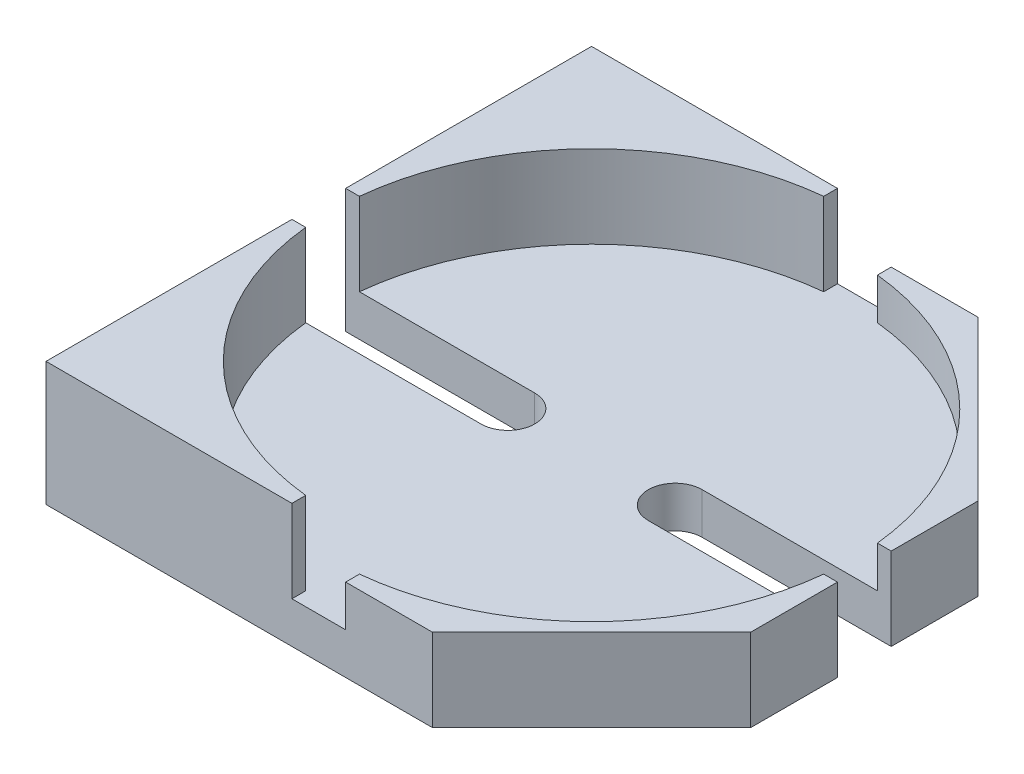
ISO-10303-21;
HEADER;
FILE_DESCRIPTION(('STEP AP214'),'2;1');
FILE_NAME('part.step','',(''),(''),'','','');
FILE_SCHEMA(('AUTOMOTIVE_DESIGN { 1 0 10303 214 1 1 1 1 }'));
ENDSEC;
DATA;
#1=APPLICATION_CONTEXT('core data for automotive mechanical design processes');
#2=APPLICATION_PROTOCOL_DEFINITION('international standard','automotive_design',2000,#1);
#3=PRODUCT_CONTEXT('',#1,'mechanical');
#4=PRODUCT('Part','Part','',(#3));
#5=PRODUCT_RELATED_PRODUCT_CATEGORY('part','',(#4));
#6=PRODUCT_DEFINITION_FORMATION('','',#4);
#7=PRODUCT_DEFINITION_CONTEXT('part definition',#1,'design');
#8=PRODUCT_DEFINITION('design','',#6,#7);
#9=PRODUCT_DEFINITION_SHAPE('','',#8);
#10=(LENGTH_UNIT() NAMED_UNIT(*) SI_UNIT(.MILLI.,.METRE.));
#11=(NAMED_UNIT(*) PLANE_ANGLE_UNIT() SI_UNIT($,.RADIAN.));
#12=(NAMED_UNIT(*) SI_UNIT($,.STERADIAN.) SOLID_ANGLE_UNIT());
#13=UNCERTAINTY_MEASURE_WITH_UNIT(LENGTH_MEASURE(1.E-05),#10,'distance_accuracy_value','');
#14=(GEOMETRIC_REPRESENTATION_CONTEXT(3) GLOBAL_UNCERTAINTY_ASSIGNED_CONTEXT((#13)) GLOBAL_UNIT_ASSIGNED_CONTEXT((#10,
#11,#12)) REPRESENTATION_CONTEXT('',''));
#15=CARTESIAN_POINT('',(0.,0.,0.));
#16=DIRECTION('',(0.,0.,1.));
#17=DIRECTION('',(1.,0.,0.));
#18=AXIS2_PLACEMENT_3D('',#15,#16,#17);
#19=CARTESIAN_POINT('',(0.,1.,0.));
#20=DIRECTION('',(0.,1.,0.));
#21=DIRECTION('',(1.,0.,0.));
#22=AXIS2_PLACEMENT_3D('',#19,#20,#21);
#23=PLANE('',#22);
#24=CARTESIAN_POINT('',(0.,1.,0.));
#25=DIRECTION('',(0.,1.,0.));
#26=DIRECTION('',(0.,0.,1.));
#27=AXIS2_PLACEMENT_3D('',#24,#25,#26);
#28=CIRCLE('',#27,3.15);
#29=CARTESIAN_POINT('',(0.325000000000011,1.,3.13318926973778));
#30=VERTEX_POINT('',#29);
#31=CARTESIAN_POINT('',(3.13318926973778,1.,0.325));
#32=VERTEX_POINT('',#31);
#33=EDGE_CURVE('E21',#30,#32,#28,.T.);
#34=ORIENTED_EDGE('',*,*,#33,.F.);
#35=DIRECTION('',(0.,0.,-1.));
#36=VECTOR('',#35,1.);
#37=CARTESIAN_POINT('',(0.325000000000011,1.,0.));
#38=LINE('',#37,#36);
#39=CARTESIAN_POINT('',(0.325000000000011,1.,3.3));
#40=VERTEX_POINT('',#39);
#41=EDGE_CURVE('E11',#40,#30,#38,.T.);
#42=ORIENTED_EDGE('',*,*,#41,.F.);
#43=DIRECTION('',(1.,0.,0.));
#44=VECTOR('',#43,1.);
#45=CARTESIAN_POINT('',(0.,1.,3.3));
#46=LINE('',#45,#44);
#47=CARTESIAN_POINT('',(1.37500000000002,1.,3.3));
#48=VERTEX_POINT('',#47);
#49=EDGE_CURVE('E261',#40,#48,#46,.T.);
#50=ORIENTED_EDGE('',*,*,#49,.T.);
#51=DIRECTION('',(0.707106781186544,0.,-0.707106781186552));
#52=VECTOR('',#51,1.);
#53=CARTESIAN_POINT('',(2.3375,1.,2.3375));
#54=LINE('',#53,#52);
#55=CARTESIAN_POINT('',(3.3,1.,1.375));
#56=VERTEX_POINT('',#55);
#57=EDGE_CURVE('E345',#48,#56,#54,.T.);
#58=ORIENTED_EDGE('',*,*,#57,.T.);
#59=DIRECTION('',(0.,0.,-1.));
#60=VECTOR('',#59,1.);
#61=CARTESIAN_POINT('',(3.3,1.,0.));
#62=LINE('',#61,#60);
#63=CARTESIAN_POINT('',(3.3,1.,0.325));
#64=VERTEX_POINT('',#63);
#65=EDGE_CURVE('E363',#56,#64,#62,.T.);
#66=ORIENTED_EDGE('',*,*,#65,.T.);
#67=DIRECTION('',(-1.,0.,0.));
#68=VECTOR('',#67,1.);
#69=CARTESIAN_POINT('',(0.,1.,0.325));
#70=LINE('',#69,#68);
#71=EDGE_CURVE('E317',#64,#32,#70,.T.);
#72=ORIENTED_EDGE('',*,*,#71,.T.);
#73=EDGE_LOOP('',(#34,#42,#50,#58,#66,#72));
#74=FACE_BOUND('',#73,.T.);
#75=ADVANCED_FACE('F17',(#74),#23,.T.);
#76=CARTESIAN_POINT('',(0.325000000000011,1.,0.));
#77=DIRECTION('',(-1.,0.,0.));
#78=DIRECTION('',(0.,0.,1.));
#79=AXIS2_PLACEMENT_3D('',#76,#77,#78);
#80=PLANE('',#79);
#81=DIRECTION('',(0.,0.,-1.));
#82=VECTOR('',#81,1.);
#83=CARTESIAN_POINT('',(0.325000000000011,0.5,0.));
#84=LINE('',#83,#82);
#85=CARTESIAN_POINT('',(0.325000000000011,0.5,3.3));
#86=VERTEX_POINT('',#85);
#87=CARTESIAN_POINT('',(0.325000000000011,0.5,3.13318926973778));
#88=VERTEX_POINT('',#87);
#89=EDGE_CURVE('E266',#86,#88,#84,.T.);
#90=ORIENTED_EDGE('',*,*,#89,.F.);
#91=DIRECTION('',(0.,-1.,0.));
#92=VECTOR('',#91,1.);
#93=CARTESIAN_POINT('',(0.325000000000011,1.,3.3));
#94=LINE('',#93,#92);
#95=EDGE_CURVE('E251',#40,#86,#94,.T.);
#96=ORIENTED_EDGE('',*,*,#95,.F.);
#97=ORIENTED_EDGE('',*,*,#41,.T.);
#98=DIRECTION('',(0.,-1.,0.));
#99=VECTOR('',#98,1.);
#100=CARTESIAN_POINT('',(0.325000000000011,1.,3.13318926973778));
#101=LINE('',#100,#99);
#102=EDGE_CURVE('E268',#30,#88,#101,.T.);
#103=ORIENTED_EDGE('',*,*,#102,.T.);
#104=EDGE_LOOP('',(#90,#96,#97,#103));
#105=FACE_BOUND('',#104,.T.);
#106=ADVANCED_FACE('F19',(#105),#80,.T.);
#107=CARTESIAN_POINT('',(0.,1.,0.));
#108=DIRECTION('',(0.,-1.,0.));
#109=DIRECTION('',(0.,0.,-1.));
#110=AXIS2_PLACEMENT_3D('',#107,#108,#109);
#111=CYLINDRICAL_SURFACE('',#110,3.15);
#112=CARTESIAN_POINT('',(0.,0.5,0.));
#113=DIRECTION('',(0.,1.,0.));
#114=DIRECTION('',(0.,0.,1.));
#115=AXIS2_PLACEMENT_3D('',#112,#113,#114);
#116=CIRCLE('',#115,3.15);
#117=CARTESIAN_POINT('',(3.13318926973778,0.5,0.325));
#118=VERTEX_POINT('',#117);
#119=EDGE_CURVE('E1458',#88,#118,#116,.T.);
#120=ORIENTED_EDGE('',*,*,#119,.F.);
#121=ORIENTED_EDGE('',*,*,#102,.F.);
#122=ORIENTED_EDGE('',*,*,#33,.T.);
#123=DIRECTION('',(0.,-1.,0.));
#124=VECTOR('',#123,1.);
#125=CARTESIAN_POINT('',(3.13318926973778,1.,0.325));
#126=LINE('',#125,#124);
#127=EDGE_CURVE('E289',#32,#118,#126,.T.);
#128=ORIENTED_EDGE('',*,*,#127,.T.);
#129=EDGE_LOOP('',(#120,#121,#122,#128));
#130=FACE_BOUND('',#129,.T.);
#131=ADVANCED_FACE('F494',(#130),#111,.F.);
#132=CARTESIAN_POINT('',(0.,1.,0.));
#133=DIRECTION('',(0.,1.,0.));
#134=DIRECTION('',(1.,0.,0.));
#135=AXIS2_PLACEMENT_3D('',#132,#133,#134);
#136=PLANE('',#135);
#137=CARTESIAN_POINT('',(0.,1.,0.));
#138=DIRECTION('',(0.,1.,0.));
#139=DIRECTION('',(0.,0.,1.));
#140=AXIS2_PLACEMENT_3D('',#137,#138,#139);
#141=CIRCLE('',#140,3.15);
#142=CARTESIAN_POINT('',(3.13318926973778,1.,-0.325));
#143=VERTEX_POINT('',#142);
#144=CARTESIAN_POINT('',(0.325000000000005,1.,-3.13318926973778));
#145=VERTEX_POINT('',#144);
#146=EDGE_CURVE('E371',#143,#145,#141,.T.);
#147=ORIENTED_EDGE('',*,*,#146,.F.);
#148=DIRECTION('',(1.,0.,0.));
#149=VECTOR('',#148,1.);
#150=CARTESIAN_POINT('',(0.,1.,-0.325));
#151=LINE('',#150,#149);
#152=CARTESIAN_POINT('',(3.3,1.,-0.325));
#153=VERTEX_POINT('',#152);
#154=EDGE_CURVE('E400',#143,#153,#151,.T.);
#155=ORIENTED_EDGE('',*,*,#154,.T.);
#156=DIRECTION('',(0.,0.,-1.));
#157=VECTOR('',#156,1.);
#158=CARTESIAN_POINT('',(3.3,1.,0.));
#159=LINE('',#158,#157);
#160=CARTESIAN_POINT('',(3.3,1.,-1.375));
#161=VERTEX_POINT('',#160);
#162=EDGE_CURVE('E296',#153,#161,#159,.T.);
#163=ORIENTED_EDGE('',*,*,#162,.T.);
#164=DIRECTION('',(-0.707106781186549,0.,-0.707106781186546));
#165=VECTOR('',#164,1.);
#166=CARTESIAN_POINT('',(2.3375,1.,-2.3375));
#167=LINE('',#166,#165);
#168=CARTESIAN_POINT('',(1.375,1.,-3.3));
#169=VERTEX_POINT('',#168);
#170=EDGE_CURVE('E436',#161,#169,#167,.T.);
#171=ORIENTED_EDGE('',*,*,#170,.T.);
#172=DIRECTION('',(-1.,0.,0.));
#173=VECTOR('',#172,1.);
#174=CARTESIAN_POINT('',(0.,1.,-3.3));
#175=LINE('',#174,#173);
#176=CARTESIAN_POINT('',(0.325000000000005,1.,-3.3));
#177=VERTEX_POINT('',#176);
#178=EDGE_CURVE('E456',#169,#177,#175,.T.);
#179=ORIENTED_EDGE('',*,*,#178,.T.);
#180=DIRECTION('',(0.,0.,1.));
#181=VECTOR('',#180,1.);
#182=CARTESIAN_POINT('',(0.325000000000005,1.,0.));
#183=LINE('',#182,#181);
#184=EDGE_CURVE('E49',#177,#145,#183,.T.);
#185=ORIENTED_EDGE('',*,*,#184,.T.);
#186=EDGE_LOOP('',(#147,#155,#163,#171,#179,#185));
#187=FACE_BOUND('',#186,.T.);
#188=ADVANCED_FACE('F1038',(#187),#136,.T.);
#189=CARTESIAN_POINT('',(0.325000000000005,1.,0.));
#190=DIRECTION('',(1.,0.,0.));
#191=DIRECTION('',(0.,1.,0.));
#192=AXIS2_PLACEMENT_3D('',#189,#190,#191);
#193=PLANE('',#192);
#194=DIRECTION('',(0.,0.,1.));
#195=VECTOR('',#194,1.);
#196=CARTESIAN_POINT('',(0.325000000000005,0.5,0.));
#197=LINE('',#196,#195);
#198=CARTESIAN_POINT('',(0.325000000000005,0.5,-3.3));
#199=VERTEX_POINT('',#198);
#200=CARTESIAN_POINT('',(0.325000000000005,0.5,-3.13318926973778));
#201=VERTEX_POINT('',#200);
#202=EDGE_CURVE('E650',#199,#201,#197,.T.);
#203=ORIENTED_EDGE('',*,*,#202,.T.);
#204=DIRECTION('',(0.,-1.,0.));
#205=VECTOR('',#204,1.);
#206=CARTESIAN_POINT('',(0.325000000000005,1.,-3.13318926973778));
#207=LINE('',#206,#205);
#208=EDGE_CURVE('E368',#145,#201,#207,.T.);
#209=ORIENTED_EDGE('',*,*,#208,.F.);
#210=ORIENTED_EDGE('',*,*,#184,.F.);
#211=DIRECTION('',(0.,-1.,0.));
#212=VECTOR('',#211,1.);
#213=CARTESIAN_POINT('',(0.325000000000005,1.,-3.3));
#214=LINE('',#213,#212);
#215=EDGE_CURVE('E455',#177,#199,#214,.T.);
#216=ORIENTED_EDGE('',*,*,#215,.T.);
#217=EDGE_LOOP('',(#203,#209,#210,#216));
#218=FACE_BOUND('',#217,.T.);
#219=ADVANCED_FACE('F1029',(#218),#193,.F.);
#220=CARTESIAN_POINT('',(0.,1.,0.));
#221=DIRECTION('',(0.,-1.,0.));
#222=DIRECTION('',(0.,0.,-1.));
#223=AXIS2_PLACEMENT_3D('',#220,#221,#222);
#224=CYLINDRICAL_SURFACE('',#223,3.15);
#225=CARTESIAN_POINT('',(0.,0.5,0.));
#226=DIRECTION('',(0.,1.,0.));
#227=DIRECTION('',(0.,0.,1.));
#228=AXIS2_PLACEMENT_3D('',#225,#226,#227);
#229=CIRCLE('',#228,3.15);
#230=CARTESIAN_POINT('',(3.13318926973778,0.5,-0.325));
#231=VERTEX_POINT('',#230);
#232=EDGE_CURVE('E655',#231,#201,#229,.T.);
#233=ORIENTED_EDGE('',*,*,#232,.F.);
#234=DIRECTION('',(0.,-1.,0.));
#235=VECTOR('',#234,1.);
#236=CARTESIAN_POINT('',(3.13318926973778,1.,-0.325));
#237=LINE('',#236,#235);
#238=EDGE_CURVE('E404',#143,#231,#237,.T.);
#239=ORIENTED_EDGE('',*,*,#238,.F.);
#240=ORIENTED_EDGE('',*,*,#146,.T.);
#241=ORIENTED_EDGE('',*,*,#208,.T.);
#242=EDGE_LOOP('',(#233,#239,#240,#241));
#243=FACE_BOUND('',#242,.T.);
#244=ADVANCED_FACE('F1020',(#243),#224,.F.);
#245=CARTESIAN_POINT('',(0.,1.5,0.));
#246=DIRECTION('',(0.,1.,0.));
#247=DIRECTION('',(1.,0.,0.));
#248=AXIS2_PLACEMENT_3D('',#245,#246,#247);
#249=PLANE('',#248);
#250=CARTESIAN_POINT('',(0.,1.5,0.));
#251=DIRECTION('',(0.,1.,0.));
#252=DIRECTION('',(0.,0.,1.));
#253=AXIS2_PLACEMENT_3D('',#250,#251,#252);
#254=CIRCLE('',#253,3.15);
#255=CARTESIAN_POINT('',(-3.13318926973778,1.5,0.325));
#256=VERTEX_POINT('',#255);
#257=CARTESIAN_POINT('',(-0.325,1.5,3.13318926973778));
#258=VERTEX_POINT('',#257);
#259=EDGE_CURVE('E411',#256,#258,#254,.T.);
#260=ORIENTED_EDGE('',*,*,#259,.F.);
#261=DIRECTION('',(-1.,0.,0.));
#262=VECTOR('',#261,1.);
#263=CARTESIAN_POINT('',(0.,1.5,0.325));
#264=LINE('',#263,#262);
#265=CARTESIAN_POINT('',(-3.3,1.5,0.325));
#266=VERTEX_POINT('',#265);
#267=EDGE_CURVE('E470',#256,#266,#264,.T.);
#268=ORIENTED_EDGE('',*,*,#267,.T.);
#269=DIRECTION('',(0.,0.,1.));
#270=VECTOR('',#269,1.);
#271=CARTESIAN_POINT('',(-3.3,1.5,0.));
#272=LINE('',#271,#270);
#273=CARTESIAN_POINT('',(-3.3,1.5,3.3));
#274=VERTEX_POINT('',#273);
#275=EDGE_CURVE('E312',#266,#274,#272,.T.);
#276=ORIENTED_EDGE('',*,*,#275,.T.);
#277=DIRECTION('',(1.,0.,0.));
#278=VECTOR('',#277,1.);
#279=CARTESIAN_POINT('',(0.,1.5,3.3));
#280=LINE('',#279,#278);
#281=CARTESIAN_POINT('',(-0.325,1.5,3.3));
#282=VERTEX_POINT('',#281);
#283=EDGE_CURVE('E333',#274,#282,#280,.T.);
#284=ORIENTED_EDGE('',*,*,#283,.T.);
#285=DIRECTION('',(0.,0.,-1.));
#286=VECTOR('',#285,1.);
#287=CARTESIAN_POINT('',(-0.325,1.5,0.));
#288=LINE('',#287,#286);
#289=EDGE_CURVE('E482',#282,#258,#288,.T.);
#290=ORIENTED_EDGE('',*,*,#289,.T.);
#291=EDGE_LOOP('',(#260,#268,#276,#284,#290));
#292=FACE_BOUND('',#291,.T.);
#293=ADVANCED_FACE('F1011',(#292),#249,.T.);
#294=CARTESIAN_POINT('',(-0.325,1.5,0.));
#295=DIRECTION('',(-1.,0.,0.));
#296=DIRECTION('',(0.,0.,1.));
#297=AXIS2_PLACEMENT_3D('',#294,#295,#296);
#298=PLANE('',#297);
#299=DIRECTION('',(0.,0.,-1.));
#300=VECTOR('',#299,1.);
#301=CARTESIAN_POINT('',(-0.325,0.5,0.));
#302=LINE('',#301,#300);
#303=CARTESIAN_POINT('',(-0.325,0.5,3.3));
#304=VERTEX_POINT('',#303);
#305=CARTESIAN_POINT('',(-0.325,0.5,3.13318926973778));
#306=VERTEX_POINT('',#305);
#307=EDGE_CURVE('E278',#304,#306,#302,.T.);
#308=ORIENTED_EDGE('',*,*,#307,.T.);
#309=DIRECTION('',(0.,-1.,0.));
#310=VECTOR('',#309,1.);
#311=CARTESIAN_POINT('',(-0.325,1.5,3.13318926973778));
#312=LINE('',#311,#310);
#313=EDGE_CURVE('E479',#258,#306,#312,.T.);
#314=ORIENTED_EDGE('',*,*,#313,.F.);
#315=ORIENTED_EDGE('',*,*,#289,.F.);
#316=DIRECTION('',(0.,-1.,0.));
#317=VECTOR('',#316,1.);
#318=CARTESIAN_POINT('',(-0.325,1.5,3.3));
#319=LINE('',#318,#317);
#320=EDGE_CURVE('E263',#282,#304,#319,.T.);
#321=ORIENTED_EDGE('',*,*,#320,.T.);
#322=EDGE_LOOP('',(#308,#314,#315,#321));
#323=FACE_BOUND('',#322,.T.);
#324=ADVANCED_FACE('F1002',(#323),#298,.F.);
#325=CARTESIAN_POINT('',(0.,1.5,0.));
#326=DIRECTION('',(0.,-1.,0.));
#327=DIRECTION('',(0.,0.,-1.));
#328=AXIS2_PLACEMENT_3D('',#325,#326,#327);
#329=CYLINDRICAL_SURFACE('',#328,3.15);
#330=CARTESIAN_POINT('',(0.,0.5,0.));
#331=DIRECTION('',(0.,1.,0.));
#332=DIRECTION('',(0.,0.,1.));
#333=AXIS2_PLACEMENT_3D('',#330,#331,#332);
#334=CIRCLE('',#333,3.15);
#335=CARTESIAN_POINT('',(-3.13318926973778,0.5,0.325));
#336=VERTEX_POINT('',#335);
#337=EDGE_CURVE('E285',#336,#306,#334,.T.);
#338=ORIENTED_EDGE('',*,*,#337,.F.);
#339=DIRECTION('',(0.,-1.,0.));
#340=VECTOR('',#339,1.);
#341=CARTESIAN_POINT('',(-3.13318926973778,1.5,0.325));
#342=LINE('',#341,#340);
#343=EDGE_CURVE('E473',#256,#336,#342,.T.);
#344=ORIENTED_EDGE('',*,*,#343,.F.);
#345=ORIENTED_EDGE('',*,*,#259,.T.);
#346=ORIENTED_EDGE('',*,*,#313,.T.);
#347=EDGE_LOOP('',(#338,#344,#345,#346));
#348=FACE_BOUND('',#347,.T.);
#349=ADVANCED_FACE('F993',(#348),#329,.F.);
#350=CARTESIAN_POINT('',(0.,1.5,0.));
#351=DIRECTION('',(0.,1.,0.));
#352=DIRECTION('',(1.,0.,0.));
#353=AXIS2_PLACEMENT_3D('',#350,#351,#352);
#354=PLANE('',#353);
#355=CARTESIAN_POINT('',(0.,1.5,0.));
#356=DIRECTION('',(0.,1.,0.));
#357=DIRECTION('',(0.,0.,1.));
#358=AXIS2_PLACEMENT_3D('',#355,#356,#357);
#359=CIRCLE('',#358,3.15);
#360=CARTESIAN_POINT('',(-0.325000000000007,1.5,-3.13318926973778));
#361=VERTEX_POINT('',#360);
#362=CARTESIAN_POINT('',(-3.13318926973778,1.5,-0.325));
#363=VERTEX_POINT('',#362);
#364=EDGE_CURVE('E412',#361,#363,#359,.T.);
#365=ORIENTED_EDGE('',*,*,#364,.F.);
#366=DIRECTION('',(0.,0.,1.));
#367=VECTOR('',#366,1.);
#368=CARTESIAN_POINT('',(-0.325000000000009,1.5,0.));
#369=LINE('',#368,#367);
#370=CARTESIAN_POINT('',(-0.325000000000007,1.5,-3.3));
#371=VERTEX_POINT('',#370);
#372=EDGE_CURVE('E408',#371,#361,#369,.T.);
#373=ORIENTED_EDGE('',*,*,#372,.F.);
#374=DIRECTION('',(-1.,0.,0.));
#375=VECTOR('',#374,1.);
#376=CARTESIAN_POINT('',(0.,1.5,-3.3));
#377=LINE('',#376,#375);
#378=CARTESIAN_POINT('',(-3.3,1.5,-3.3));
#379=VERTEX_POINT('',#378);
#380=EDGE_CURVE('E448',#371,#379,#377,.T.);
#381=ORIENTED_EDGE('',*,*,#380,.T.);
#382=DIRECTION('',(0.,0.,1.));
#383=VECTOR('',#382,1.);
#384=CARTESIAN_POINT('',(-3.3,1.5,0.));
#385=LINE('',#384,#383);
#386=CARTESIAN_POINT('',(-3.3,1.5,-0.325));
#387=VERTEX_POINT('',#386);
#388=EDGE_CURVE('E294',#379,#387,#385,.T.);
#389=ORIENTED_EDGE('',*,*,#388,.T.);
#390=DIRECTION('',(1.,0.,0.));
#391=VECTOR('',#390,1.);
#392=CARTESIAN_POINT('',(0.,1.5,-0.325));
#393=LINE('',#392,#391);
#394=EDGE_CURVE('E419',#387,#363,#393,.T.);
#395=ORIENTED_EDGE('',*,*,#394,.T.);
#396=EDGE_LOOP('',(#365,#373,#381,#389,#395));
#397=FACE_BOUND('',#396,.T.);
#398=ADVANCED_FACE('F896',(#397),#354,.T.);
#399=CARTESIAN_POINT('',(-0.325000000000009,1.5,0.));
#400=DIRECTION('',(1.,0.,0.));
#401=DIRECTION('',(0.,0.,1.));
#402=AXIS2_PLACEMENT_3D('',#399,#400,#401);
#403=PLANE('',#402);
#404=DIRECTION('',(0.,0.,1.));
#405=VECTOR('',#404,1.);
#406=CARTESIAN_POINT('',(-0.325000000000009,0.5,0.));
#407=LINE('',#406,#405);
#408=CARTESIAN_POINT('',(-0.325000000000007,0.5,-3.3));
#409=VERTEX_POINT('',#408);
#410=CARTESIAN_POINT('',(-0.325000000000007,0.5,-3.13318926973778));
#411=VERTEX_POINT('',#410);
#412=EDGE_CURVE('E1472',#409,#411,#407,.T.);
#413=ORIENTED_EDGE('',*,*,#412,.F.);
#414=DIRECTION('',(0.,-1.,0.));
#415=VECTOR('',#414,1.);
#416=CARTESIAN_POINT('',(-0.325000000000007,1.5,-3.3));
#417=LINE('',#416,#415);
#418=EDGE_CURVE('E452',#371,#409,#417,.T.);
#419=ORIENTED_EDGE('',*,*,#418,.F.);
#420=ORIENTED_EDGE('',*,*,#372,.T.);
#421=DIRECTION('',(0.,-1.,0.));
#422=VECTOR('',#421,1.);
#423=CARTESIAN_POINT('',(-0.325000000000007,1.5,-3.13318926973778));
#424=LINE('',#423,#422);
#425=EDGE_CURVE('E415',#361,#411,#424,.T.);
#426=ORIENTED_EDGE('',*,*,#425,.T.);
#427=EDGE_LOOP('',(#413,#419,#420,#426));
#428=FACE_BOUND('',#427,.T.);
#429=ADVANCED_FACE('F891',(#428),#403,.T.);
#430=CARTESIAN_POINT('',(0.,1.5,0.));
#431=DIRECTION('',(0.,-1.,0.));
#432=DIRECTION('',(0.,0.,-1.));
#433=AXIS2_PLACEMENT_3D('',#430,#431,#432);
#434=CYLINDRICAL_SURFACE('',#433,3.15);
#435=CARTESIAN_POINT('',(0.,0.5,0.));
#436=DIRECTION('',(0.,1.,0.));
#437=DIRECTION('',(0.,0.,1.));
#438=AXIS2_PLACEMENT_3D('',#435,#436,#437);
#439=CIRCLE('',#438,3.15);
#440=CARTESIAN_POINT('',(-3.13318926973778,0.5,-0.325));
#441=VERTEX_POINT('',#440);
#442=EDGE_CURVE('E601',#411,#441,#439,.T.);
#443=ORIENTED_EDGE('',*,*,#442,.F.);
#444=ORIENTED_EDGE('',*,*,#425,.F.);
#445=ORIENTED_EDGE('',*,*,#364,.T.);
#446=DIRECTION('',(0.,-1.,0.));
#447=VECTOR('',#446,1.);
#448=CARTESIAN_POINT('',(-3.13318926973778,1.5,-0.325));
#449=LINE('',#448,#447);
#450=EDGE_CURVE('E354',#363,#441,#449,.T.);
#451=ORIENTED_EDGE('',*,*,#450,.T.);
#452=EDGE_LOOP('',(#443,#444,#445,#451));
#453=FACE_BOUND('',#452,.T.);
#454=ADVANCED_FACE('F895',(#453),#434,.F.);
#455=CARTESIAN_POINT('',(1.0125,0.,0.));
#456=DIRECTION('',(0.,1.,0.));
#457=DIRECTION('',(1.,0.,0.));
#458=AXIS2_PLACEMENT_3D('',#455,#456,#457);
#459=PLANE('',#458);
#460=DIRECTION('',(0.,0.,1.));
#461=VECTOR('',#460,1.);
#462=CARTESIAN_POINT('',(-3.3,0.,0.325));
#463=LINE('',#462,#461);
#464=CARTESIAN_POINT('',(-3.3,0.,0.325));
#465=VERTEX_POINT('',#464);
#466=CARTESIAN_POINT('',(-3.3,0.,3.3));
#467=VERTEX_POINT('',#466);
#468=EDGE_CURVE('E273',#465,#467,#463,.T.);
#469=ORIENTED_EDGE('',*,*,#468,.F.);
#470=DIRECTION('',(-1.,0.,0.));
#471=VECTOR('',#470,1.);
#472=CARTESIAN_POINT('',(-1.0125,0.,0.325));
#473=LINE('',#472,#471);
#474=CARTESIAN_POINT('',(-1.0125,0.,0.325));
#475=VERTEX_POINT('',#474);
#476=EDGE_CURVE('E395',#475,#465,#473,.T.);
#477=ORIENTED_EDGE('',*,*,#476,.F.);
#478=CARTESIAN_POINT('',(-1.0125,0.,0.));
#479=DIRECTION('',(0.,-1.,0.));
#480=DIRECTION('',(0.,0.,1.));
#481=AXIS2_PLACEMENT_3D('',#478,#479,#480);
#482=CIRCLE('',#481,0.325);
#483=CARTESIAN_POINT('',(-1.0125,0.,-0.325));
#484=VERTEX_POINT('',#483);
#485=EDGE_CURVE('E396',#484,#475,#482,.T.);
#486=ORIENTED_EDGE('',*,*,#485,.F.);
#487=DIRECTION('',(1.,0.,0.));
#488=VECTOR('',#487,1.);
#489=CARTESIAN_POINT('',(-1.0125,0.,-0.325));
#490=LINE('',#489,#488);
#491=CARTESIAN_POINT('',(-3.3,0.,-0.325));
#492=VERTEX_POINT('',#491);
#493=EDGE_CURVE('E355',#492,#484,#490,.T.);
#494=ORIENTED_EDGE('',*,*,#493,.F.);
#495=DIRECTION('',(0.,0.,1.));
#496=VECTOR('',#495,1.);
#497=CARTESIAN_POINT('',(-3.3,0.,-3.3));
#498=LINE('',#497,#496);
#499=CARTESIAN_POINT('',(-3.3,0.,-3.3));
#500=VERTEX_POINT('',#499);
#501=EDGE_CURVE('E295',#500,#492,#498,.T.);
#502=ORIENTED_EDGE('',*,*,#501,.F.);
#503=DIRECTION('',(-1.,0.,0.));
#504=VECTOR('',#503,1.);
#505=CARTESIAN_POINT('',(1.375,0.,-3.3));
#506=LINE('',#505,#504);
#507=CARTESIAN_POINT('',(1.375,0.,-3.3));
#508=VERTEX_POINT('',#507);
#509=EDGE_CURVE('E440',#508,#500,#506,.T.);
#510=ORIENTED_EDGE('',*,*,#509,.F.);
#511=DIRECTION('',(-0.707106781186549,0.,-0.707106781186546));
#512=VECTOR('',#511,1.);
#513=CARTESIAN_POINT('',(1.375,0.,-3.3));
#514=LINE('',#513,#512);
#515=CARTESIAN_POINT('',(3.3,0.,-1.375));
#516=VERTEX_POINT('',#515);
#517=EDGE_CURVE('E300',#516,#508,#514,.T.);
#518=ORIENTED_EDGE('',*,*,#517,.F.);
#519=DIRECTION('',(0.,0.,-1.));
#520=VECTOR('',#519,1.);
#521=CARTESIAN_POINT('',(3.3,0.,-1.375));
#522=LINE('',#521,#520);
#523=CARTESIAN_POINT('',(3.3,0.,-0.325));
#524=VERTEX_POINT('',#523);
#525=EDGE_CURVE('E407',#524,#516,#522,.T.);
#526=ORIENTED_EDGE('',*,*,#525,.F.);
#527=DIRECTION('',(1.,0.,0.));
#528=VECTOR('',#527,1.);
#529=CARTESIAN_POINT('',(1.0125,0.,-0.325));
#530=LINE('',#529,#528);
#531=CARTESIAN_POINT('',(1.0125,0.,-0.325));
#532=VERTEX_POINT('',#531);
#533=EDGE_CURVE('E386',#532,#524,#530,.T.);
#534=ORIENTED_EDGE('',*,*,#533,.F.);
#535=CARTESIAN_POINT('',(1.0125,0.,0.));
#536=DIRECTION('',(0.,-1.,0.));
#537=DIRECTION('',(0.,0.,1.));
#538=AXIS2_PLACEMENT_3D('',#535,#536,#537);
#539=CIRCLE('',#538,0.325);
#540=CARTESIAN_POINT('',(1.0125,0.,0.325));
#541=VERTEX_POINT('',#540);
#542=EDGE_CURVE('E321',#541,#532,#539,.T.);
#543=ORIENTED_EDGE('',*,*,#542,.F.);
#544=DIRECTION('',(-1.,0.,0.));
#545=VECTOR('',#544,1.);
#546=CARTESIAN_POINT('',(1.0125,0.,0.325));
#547=LINE('',#546,#545);
#548=CARTESIAN_POINT('',(3.3,0.,0.325));
#549=VERTEX_POINT('',#548);
#550=EDGE_CURVE('E367',#549,#541,#547,.T.);
#551=ORIENTED_EDGE('',*,*,#550,.F.);
#552=DIRECTION('',(0.,0.,-1.));
#553=VECTOR('',#552,1.);
#554=CARTESIAN_POINT('',(3.3,0.,0.325));
#555=LINE('',#554,#553);
#556=CARTESIAN_POINT('',(3.3,0.,1.375));
#557=VERTEX_POINT('',#556);
#558=EDGE_CURVE('E349',#557,#549,#555,.T.);
#559=ORIENTED_EDGE('',*,*,#558,.F.);
#560=DIRECTION('',(0.707106781186544,0.,-0.707106781186552));
#561=VECTOR('',#560,1.);
#562=CARTESIAN_POINT('',(1.37500000000002,0.,3.3));
#563=LINE('',#562,#561);
#564=CARTESIAN_POINT('',(1.37500000000002,0.,3.3));
#565=VERTEX_POINT('',#564);
#566=EDGE_CURVE('E337',#565,#557,#563,.T.);
#567=ORIENTED_EDGE('',*,*,#566,.F.);
#568=DIRECTION('',(1.,0.,0.));
#569=VECTOR('',#568,1.);
#570=CARTESIAN_POINT('',(1.37500000000002,0.,3.3));
#571=LINE('',#570,#569);
#572=EDGE_CURVE('E325',#467,#565,#571,.T.);
#573=ORIENTED_EDGE('',*,*,#572,.F.);
#574=EDGE_LOOP('',(#469,#477,#486,#494,#502,#510,#518,#526,#534,#543,#551,#559,#567,#573));
#575=FACE_BOUND('',#574,.T.);
#576=ADVANCED_FACE('F934',(#575),#459,.F.);
#577=CARTESIAN_POINT('',(-1.0125,0.5,0.325));
#578=DIRECTION('',(0.,0.,1.));
#579=DIRECTION('',(1.,0.,0.));
#580=AXIS2_PLACEMENT_3D('',#577,#578,#579);
#581=PLANE('',#580);
#582=ORIENTED_EDGE('',*,*,#476,.T.);
#583=DIRECTION('',(0.,-1.,0.));
#584=VECTOR('',#583,1.);
#585=CARTESIAN_POINT('',(-3.3,0.5,0.325));
#586=LINE('',#585,#584);
#587=EDGE_CURVE('E316',#266,#465,#586,.T.);
#588=ORIENTED_EDGE('',*,*,#587,.F.);
#589=ORIENTED_EDGE('',*,*,#267,.F.);
#590=ORIENTED_EDGE('',*,*,#343,.T.);
#591=DIRECTION('',(-1.,0.,0.));
#592=VECTOR('',#591,1.);
#593=CARTESIAN_POINT('',(-1.0125,0.5,0.325));
#594=LINE('',#593,#592);
#595=CARTESIAN_POINT('',(-1.0125,0.5,0.325));
#596=VERTEX_POINT('',#595);
#597=EDGE_CURVE('E610',#596,#336,#594,.T.);
#598=ORIENTED_EDGE('',*,*,#597,.F.);
#599=DIRECTION('',(0.,-1.,0.));
#600=VECTOR('',#599,1.);
#601=CARTESIAN_POINT('',(-1.0125,0.5,0.325));
#602=LINE('',#601,#600);
#603=EDGE_CURVE('E391',#596,#475,#602,.T.);
#604=ORIENTED_EDGE('',*,*,#603,.T.);
#605=EDGE_LOOP('',(#582,#588,#589,#590,#598,#604));
#606=FACE_BOUND('',#605,.T.);
#607=ADVANCED_FACE('F885',(#606),#581,.F.);
#608=CARTESIAN_POINT('',(-1.0125,0.5,0.));
#609=DIRECTION('',(0.,-1.,0.));
#610=DIRECTION('',(0.,0.,-1.));
#611=AXIS2_PLACEMENT_3D('',#608,#609,#610);
#612=CYLINDRICAL_SURFACE('',#611,0.325);
#613=ORIENTED_EDGE('',*,*,#485,.T.);
#614=ORIENTED_EDGE('',*,*,#603,.F.);
#615=CARTESIAN_POINT('',(-1.0125,0.5,0.));
#616=DIRECTION('',(0.,-1.,0.));
#617=DIRECTION('',(0.,0.,1.));
#618=AXIS2_PLACEMENT_3D('',#615,#616,#617);
#619=CIRCLE('',#618,0.325);
#620=CARTESIAN_POINT('',(-1.0125,0.5,-0.325));
#621=VERTEX_POINT('',#620);
#622=EDGE_CURVE('E605',#621,#596,#619,.T.);
#623=ORIENTED_EDGE('',*,*,#622,.F.);
#624=DIRECTION('',(0.,-1.,0.));
#625=VECTOR('',#624,1.);
#626=CARTESIAN_POINT('',(-1.0125,0.5,-0.325));
#627=LINE('',#626,#625);
#628=EDGE_CURVE('E350',#621,#484,#627,.T.);
#629=ORIENTED_EDGE('',*,*,#628,.T.);
#630=EDGE_LOOP('',(#613,#614,#623,#629));
#631=FACE_BOUND('',#630,.T.);
#632=ADVANCED_FACE('F880',(#631),#612,.F.);
#633=CARTESIAN_POINT('',(-1.0125,0.5,-0.325));
#634=DIRECTION('',(0.,0.,-1.));
#635=DIRECTION('',(-1.,0.,0.));
#636=AXIS2_PLACEMENT_3D('',#633,#634,#635);
#637=PLANE('',#636);
#638=ORIENTED_EDGE('',*,*,#493,.T.);
#639=ORIENTED_EDGE('',*,*,#628,.F.);
#640=DIRECTION('',(1.,0.,0.));
#641=VECTOR('',#640,1.);
#642=CARTESIAN_POINT('',(-1.0125,0.5,-0.325));
#643=LINE('',#642,#641);
#644=EDGE_CURVE('E611',#441,#621,#643,.T.);
#645=ORIENTED_EDGE('',*,*,#644,.F.);
#646=ORIENTED_EDGE('',*,*,#450,.F.);
#647=ORIENTED_EDGE('',*,*,#394,.F.);
#648=DIRECTION('',(0.,-1.,0.));
#649=VECTOR('',#648,1.);
#650=CARTESIAN_POINT('',(-3.3,0.5,-0.325));
#651=LINE('',#650,#649);
#652=EDGE_CURVE('E290',#387,#492,#651,.T.);
#653=ORIENTED_EDGE('',*,*,#652,.T.);
#654=EDGE_LOOP('',(#638,#639,#645,#646,#647,#653));
#655=FACE_BOUND('',#654,.T.);
#656=ADVANCED_FACE('F884',(#655),#637,.F.);
#657=CARTESIAN_POINT('',(-3.3,0.5,-3.3));
#658=DIRECTION('',(1.,0.,0.));
#659=DIRECTION('',(0.,1.,0.));
#660=AXIS2_PLACEMENT_3D('',#657,#658,#659);
#661=PLANE('',#660);
#662=ORIENTED_EDGE('',*,*,#501,.T.);
#663=ORIENTED_EDGE('',*,*,#652,.F.);
#664=ORIENTED_EDGE('',*,*,#388,.F.);
#665=DIRECTION('',(0.,-1.,0.));
#666=VECTOR('',#665,1.);
#667=CARTESIAN_POINT('',(-3.3,0.5,-3.3));
#668=LINE('',#667,#666);
#669=EDGE_CURVE('E444',#379,#500,#668,.T.);
#670=ORIENTED_EDGE('',*,*,#669,.T.);
#671=EDGE_LOOP('',(#662,#663,#664,#670));
#672=FACE_BOUND('',#671,.T.);
#673=ADVANCED_FACE('F856',(#672),#661,.F.);
#674=CARTESIAN_POINT('',(1.375,0.5,-3.3));
#675=DIRECTION('',(0.,0.,1.));
#676=DIRECTION('',(1.,0.,0.));
#677=AXIS2_PLACEMENT_3D('',#674,#675,#676);
#678=PLANE('',#677);
#679=ORIENTED_EDGE('',*,*,#509,.T.);
#680=ORIENTED_EDGE('',*,*,#669,.F.);
#681=ORIENTED_EDGE('',*,*,#380,.F.);
#682=ORIENTED_EDGE('',*,*,#418,.T.);
#683=DIRECTION('',(-1.,0.,0.));
#684=VECTOR('',#683,1.);
#685=CARTESIAN_POINT('',(1.375,0.5,-3.3));
#686=LINE('',#685,#684);
#687=EDGE_CURVE('E646',#199,#409,#686,.T.);
#688=ORIENTED_EDGE('',*,*,#687,.F.);
#689=ORIENTED_EDGE('',*,*,#215,.F.);
#690=ORIENTED_EDGE('',*,*,#178,.F.);
#691=DIRECTION('',(0.,-1.,0.));
#692=VECTOR('',#691,1.);
#693=CARTESIAN_POINT('',(1.375,0.5,-3.3));
#694=LINE('',#693,#692);
#695=EDGE_CURVE('E432',#169,#508,#694,.T.);
#696=ORIENTED_EDGE('',*,*,#695,.T.);
#697=EDGE_LOOP('',(#679,#680,#681,#682,#688,#689,#690,#696));
#698=FACE_BOUND('',#697,.T.);
#699=ADVANCED_FACE('F851',(#698),#678,.F.);
#700=CARTESIAN_POINT('',(1.375,0.5,-3.3));
#701=DIRECTION('',(-0.707106781186546,0.,0.707106781186549));
#702=DIRECTION('',(0.,1.,0.));
#703=AXIS2_PLACEMENT_3D('',#700,#701,#702);
#704=PLANE('',#703);
#705=ORIENTED_EDGE('',*,*,#517,.T.);
#706=ORIENTED_EDGE('',*,*,#695,.F.);
#707=ORIENTED_EDGE('',*,*,#170,.F.);
#708=DIRECTION('',(0.,-1.,0.));
#709=VECTOR('',#708,1.);
#710=CARTESIAN_POINT('',(3.3,0.5,-1.375));
#711=LINE('',#710,#709);
#712=EDGE_CURVE('E301',#161,#516,#711,.T.);
#713=ORIENTED_EDGE('',*,*,#712,.T.);
#714=EDGE_LOOP('',(#705,#706,#707,#713));
#715=FACE_BOUND('',#714,.T.);
#716=ADVANCED_FACE('F855',(#715),#704,.F.);
#717=CARTESIAN_POINT('',(3.3,0.5,-1.375));
#718=DIRECTION('',(-1.,0.,0.));
#719=DIRECTION('',(0.,0.,1.));
#720=AXIS2_PLACEMENT_3D('',#717,#718,#719);
#721=PLANE('',#720);
#722=ORIENTED_EDGE('',*,*,#525,.T.);
#723=ORIENTED_EDGE('',*,*,#712,.F.);
#724=ORIENTED_EDGE('',*,*,#162,.F.);
#725=DIRECTION('',(0.,-1.,0.));
#726=VECTOR('',#725,1.);
#727=CARTESIAN_POINT('',(3.3,0.5,-0.325));
#728=LINE('',#727,#726);
#729=EDGE_CURVE('E390',#153,#524,#728,.T.);
#730=ORIENTED_EDGE('',*,*,#729,.T.);
#731=EDGE_LOOP('',(#722,#723,#724,#730));
#732=FACE_BOUND('',#731,.T.);
#733=ADVANCED_FACE('F905',(#732),#721,.F.);
#734=CARTESIAN_POINT('',(1.0125,0.5,-0.325));
#735=DIRECTION('',(0.,0.,-1.));
#736=DIRECTION('',(0.,-1.,0.));
#737=AXIS2_PLACEMENT_3D('',#734,#735,#736);
#738=PLANE('',#737);
#739=ORIENTED_EDGE('',*,*,#533,.T.);
#740=ORIENTED_EDGE('',*,*,#729,.F.);
#741=ORIENTED_EDGE('',*,*,#154,.F.);
#742=ORIENTED_EDGE('',*,*,#238,.T.);
#743=DIRECTION('',(1.,0.,0.));
#744=VECTOR('',#743,1.);
#745=CARTESIAN_POINT('',(1.0125,0.5,-0.325));
#746=LINE('',#745,#744);
#747=CARTESIAN_POINT('',(1.0125,0.5,-0.325));
#748=VERTEX_POINT('',#747);
#749=EDGE_CURVE('E1450',#748,#231,#746,.T.);
#750=ORIENTED_EDGE('',*,*,#749,.F.);
#751=DIRECTION('',(0.,-1.,0.));
#752=VECTOR('',#751,1.);
#753=CARTESIAN_POINT('',(1.0125,0.5,-0.325));
#754=LINE('',#753,#752);
#755=EDGE_CURVE('E382',#748,#532,#754,.T.);
#756=ORIENTED_EDGE('',*,*,#755,.T.);
#757=EDGE_LOOP('',(#739,#740,#741,#742,#750,#756));
#758=FACE_BOUND('',#757,.T.);
#759=ADVANCED_FACE('F838',(#758),#738,.F.);
#760=CARTESIAN_POINT('',(1.0125,0.5,0.));
#761=DIRECTION('',(0.,-1.,0.));
#762=DIRECTION('',(0.,0.,-1.));
#763=AXIS2_PLACEMENT_3D('',#760,#761,#762);
#764=CYLINDRICAL_SURFACE('',#763,0.325);
#765=ORIENTED_EDGE('',*,*,#542,.T.);
#766=ORIENTED_EDGE('',*,*,#755,.F.);
#767=CARTESIAN_POINT('',(1.0125,0.5,0.));
#768=DIRECTION('',(0.,-1.,0.));
#769=DIRECTION('',(0.,0.,1.));
#770=AXIS2_PLACEMENT_3D('',#767,#768,#769);
#771=CIRCLE('',#770,0.325);
#772=CARTESIAN_POINT('',(1.0125,0.5,0.325));
#773=VERTEX_POINT('',#772);
#774=EDGE_CURVE('E1446',#773,#748,#771,.T.);
#775=ORIENTED_EDGE('',*,*,#774,.F.);
#776=DIRECTION('',(0.,-1.,0.));
#777=VECTOR('',#776,1.);
#778=CARTESIAN_POINT('',(1.0125,0.5,0.325));
#779=LINE('',#778,#777);
#780=EDGE_CURVE('E375',#773,#541,#779,.T.);
#781=ORIENTED_EDGE('',*,*,#780,.T.);
#782=EDGE_LOOP('',(#765,#766,#775,#781));
#783=FACE_BOUND('',#782,.T.);
#784=ADVANCED_FACE('F834',(#783),#764,.F.);
#785=CARTESIAN_POINT('',(1.0125,0.5,0.325));
#786=DIRECTION('',(0.,0.,1.));
#787=DIRECTION('',(1.,0.,0.));
#788=AXIS2_PLACEMENT_3D('',#785,#786,#787);
#789=PLANE('',#788);
#790=ORIENTED_EDGE('',*,*,#550,.T.);
#791=ORIENTED_EDGE('',*,*,#780,.F.);
#792=DIRECTION('',(-1.,0.,0.));
#793=VECTOR('',#792,1.);
#794=CARTESIAN_POINT('',(1.0125,0.5,0.325));
#795=LINE('',#794,#793);
#796=EDGE_CURVE('E502',#118,#773,#795,.T.);
#797=ORIENTED_EDGE('',*,*,#796,.F.);
#798=ORIENTED_EDGE('',*,*,#127,.F.);
#799=ORIENTED_EDGE('',*,*,#71,.F.);
#800=DIRECTION('',(0.,-1.,0.));
#801=VECTOR('',#800,1.);
#802=CARTESIAN_POINT('',(3.3,0.5,0.325));
#803=LINE('',#802,#801);
#804=EDGE_CURVE('E359',#64,#549,#803,.T.);
#805=ORIENTED_EDGE('',*,*,#804,.T.);
#806=EDGE_LOOP('',(#790,#791,#797,#798,#799,#805));
#807=FACE_BOUND('',#806,.T.);
#808=ADVANCED_FACE('F500',(#807),#789,.F.);
#809=CARTESIAN_POINT('',(3.3,0.5,0.325));
#810=DIRECTION('',(-1.,0.,0.));
#811=DIRECTION('',(0.,0.,1.));
#812=AXIS2_PLACEMENT_3D('',#809,#810,#811);
#813=PLANE('',#812);
#814=ORIENTED_EDGE('',*,*,#558,.T.);
#815=ORIENTED_EDGE('',*,*,#804,.F.);
#816=ORIENTED_EDGE('',*,*,#65,.F.);
#817=DIRECTION('',(0.,-1.,0.));
#818=VECTOR('',#817,1.);
#819=CARTESIAN_POINT('',(3.3,0.5,1.375));
#820=LINE('',#819,#818);
#821=EDGE_CURVE('E341',#56,#557,#820,.T.);
#822=ORIENTED_EDGE('',*,*,#821,.T.);
#823=EDGE_LOOP('',(#814,#815,#816,#822));
#824=FACE_BOUND('',#823,.T.);
#825=ADVANCED_FACE('F862',(#824),#813,.F.);
#826=CARTESIAN_POINT('',(1.37500000000002,0.5,3.3));
#827=DIRECTION('',(-0.707106781186552,0.,-0.707106781186544));
#828=DIRECTION('',(-0.707106781186544,0.,0.707106781186552));
#829=AXIS2_PLACEMENT_3D('',#826,#827,#828);
#830=PLANE('',#829);
#831=ORIENTED_EDGE('',*,*,#566,.T.);
#832=ORIENTED_EDGE('',*,*,#821,.F.);
#833=ORIENTED_EDGE('',*,*,#57,.F.);
#834=DIRECTION('',(0.,-1.,0.));
#835=VECTOR('',#834,1.);
#836=CARTESIAN_POINT('',(1.37500000000002,0.5,3.3));
#837=LINE('',#836,#835);
#838=EDGE_CURVE('E308',#48,#565,#837,.T.);
#839=ORIENTED_EDGE('',*,*,#838,.T.);
#840=EDGE_LOOP('',(#831,#832,#833,#839));
#841=FACE_BOUND('',#840,.T.);
#842=ADVANCED_FACE('F866',(#841),#830,.F.);
#843=CARTESIAN_POINT('',(1.37500000000002,0.5,3.3));
#844=DIRECTION('',(0.,0.,-1.));
#845=DIRECTION('',(0.,-1.,0.));
#846=AXIS2_PLACEMENT_3D('',#843,#844,#845);
#847=PLANE('',#846);
#848=ORIENTED_EDGE('',*,*,#572,.T.);
#849=ORIENTED_EDGE('',*,*,#838,.F.);
#850=ORIENTED_EDGE('',*,*,#49,.F.);
#851=ORIENTED_EDGE('',*,*,#95,.T.);
#852=DIRECTION('',(1.,0.,0.));
#853=VECTOR('',#852,1.);
#854=CARTESIAN_POINT('',(1.37500000000002,0.5,3.3));
#855=LINE('',#854,#853);
#856=EDGE_CURVE('E257',#304,#86,#855,.T.);
#857=ORIENTED_EDGE('',*,*,#856,.F.);
#858=ORIENTED_EDGE('',*,*,#320,.F.);
#859=ORIENTED_EDGE('',*,*,#283,.F.);
#860=DIRECTION('',(0.,-1.,0.));
#861=VECTOR('',#860,1.);
#862=CARTESIAN_POINT('',(-3.3,0.5,3.3));
#863=LINE('',#862,#861);
#864=EDGE_CURVE('E305',#274,#467,#863,.T.);
#865=ORIENTED_EDGE('',*,*,#864,.T.);
#866=EDGE_LOOP('',(#848,#849,#850,#851,#857,#858,#859,#865));
#867=FACE_BOUND('',#866,.T.);
#868=ADVANCED_FACE('F254',(#867),#847,.F.);
#869=CARTESIAN_POINT('',(-3.3,0.5,0.325));
#870=DIRECTION('',(1.,0.,0.));
#871=DIRECTION('',(0.,1.,0.));
#872=AXIS2_PLACEMENT_3D('',#869,#870,#871);
#873=PLANE('',#872);
#874=ORIENTED_EDGE('',*,*,#468,.T.);
#875=ORIENTED_EDGE('',*,*,#864,.F.);
#876=ORIENTED_EDGE('',*,*,#275,.F.);
#877=ORIENTED_EDGE('',*,*,#587,.T.);
#878=EDGE_LOOP('',(#874,#875,#876,#877));
#879=FACE_BOUND('',#878,.T.);
#880=ADVANCED_FACE('F829',(#879),#873,.F.);
#881=CARTESIAN_POINT('',(1.0125,0.5,0.));
#882=DIRECTION('',(0.,1.,0.));
#883=DIRECTION('',(1.,0.,0.));
#884=AXIS2_PLACEMENT_3D('',#881,#882,#883);
#885=PLANE('',#884);
#886=ORIENTED_EDGE('',*,*,#119,.T.);
#887=ORIENTED_EDGE('',*,*,#796,.T.);
#888=ORIENTED_EDGE('',*,*,#774,.T.);
#889=ORIENTED_EDGE('',*,*,#749,.T.);
#890=ORIENTED_EDGE('',*,*,#232,.T.);
#891=ORIENTED_EDGE('',*,*,#202,.F.);
#892=ORIENTED_EDGE('',*,*,#687,.T.);
#893=ORIENTED_EDGE('',*,*,#412,.T.);
#894=ORIENTED_EDGE('',*,*,#442,.T.);
#895=ORIENTED_EDGE('',*,*,#644,.T.);
#896=ORIENTED_EDGE('',*,*,#622,.T.);
#897=ORIENTED_EDGE('',*,*,#597,.T.);
#898=ORIENTED_EDGE('',*,*,#337,.T.);
#899=ORIENTED_EDGE('',*,*,#307,.F.);
#900=ORIENTED_EDGE('',*,*,#856,.T.);
#901=ORIENTED_EDGE('',*,*,#89,.T.);
#902=EDGE_LOOP('',(#886,#887,#888,#889,#890,#891,#892,#893,#894,#895,#896,#897,#898,#899,#900,#901));
#903=FACE_BOUND('',#902,.T.);
#904=ADVANCED_FACE('F275',(#903),#885,.T.);
#905=CLOSED_SHELL('',(#75,#106,#131,#188,#219,#244,#293,#324,#349,#398,#429,#454,#576,#607,#632,
#656,#673,#699,#716,#733,#759,#784,#808,#825,#842,#868,#880,#904));
#906=MANIFOLD_SOLID_BREP('B1',#905);
#907=ADVANCED_BREP_SHAPE_REPRESENTATION('',(#18,#906),#14);
#908=SHAPE_DEFINITION_REPRESENTATION(#9,#907);
ENDSEC;
END-ISO-10303-21;
